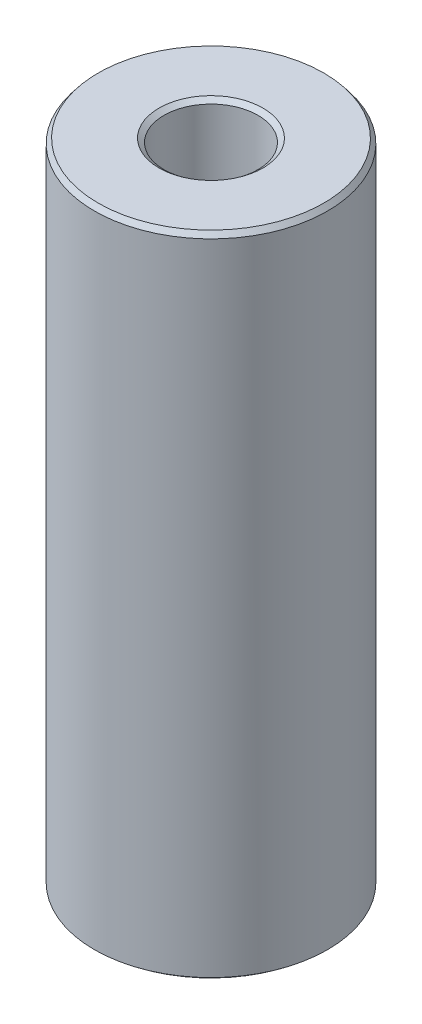
ISO-10303-21;
HEADER;
FILE_DESCRIPTION(('STEP AP214'),'2;1');
FILE_NAME('part.step','',(''),(''),'','','');
FILE_SCHEMA(('AUTOMOTIVE_DESIGN { 1 0 10303 214 1 1 1 1 }'));
ENDSEC;
DATA;
#1=APPLICATION_CONTEXT('core data for automotive mechanical design processes');
#2=APPLICATION_PROTOCOL_DEFINITION('international standard','automotive_design',2000,#1);
#3=PRODUCT_CONTEXT('',#1,'mechanical');
#4=PRODUCT('Part','Part','',(#3));
#5=PRODUCT_RELATED_PRODUCT_CATEGORY('part','',(#4));
#6=PRODUCT_DEFINITION_FORMATION('','',#4);
#7=PRODUCT_DEFINITION_CONTEXT('part definition',#1,'design');
#8=PRODUCT_DEFINITION('design','',#6,#7);
#9=PRODUCT_DEFINITION_SHAPE('','',#8);
#10=(LENGTH_UNIT() NAMED_UNIT(*) SI_UNIT(.MILLI.,.METRE.));
#11=(NAMED_UNIT(*) PLANE_ANGLE_UNIT() SI_UNIT($,.RADIAN.));
#12=(NAMED_UNIT(*) SI_UNIT($,.STERADIAN.) SOLID_ANGLE_UNIT());
#13=UNCERTAINTY_MEASURE_WITH_UNIT(LENGTH_MEASURE(1.E-05),#10,'distance_accuracy_value','');
#14=(GEOMETRIC_REPRESENTATION_CONTEXT(3) GLOBAL_UNCERTAINTY_ASSIGNED_CONTEXT((#13)) GLOBAL_UNIT_ASSIGNED_CONTEXT((#10,
#11,#12)) REPRESENTATION_CONTEXT('',''));
#15=CARTESIAN_POINT('',(0.,0.,0.));
#16=DIRECTION('',(0.,0.,1.));
#17=DIRECTION('',(1.,0.,0.));
#18=AXIS2_PLACEMENT_3D('',#15,#16,#17);
#19=CARTESIAN_POINT('',(0.,305.918689171628,0.));
#20=DIRECTION('',(0.,-1.,0.));
#21=DIRECTION('',(0.,0.,-1.));
#22=AXIS2_PLACEMENT_3D('',#19,#20,#21);
#23=CYLINDRICAL_SURFACE('',#22,55.);
#24=CARTESIAN_POINT('',(0.,1.80215994976524,0.));
#25=DIRECTION('',(0.,1.,0.));
#26=DIRECTION('',(0.,0.,1.));
#27=AXIS2_PLACEMENT_3D('',#24,#25,#26);
#28=CIRCLE('',#27,55.);
#29=CARTESIAN_POINT('',(0.,1.80215994976524,-55.));
#30=VERTEX_POINT('',#29);
#31=EDGE_CURVE('E10',#30,#30,#28,.T.);
#32=CARTESIAN_POINT('',(0.,303.600709281203,0.));
#33=DIRECTION('',(0.,1.,0.));
#34=DIRECTION('',(0.,0.,1.));
#35=AXIS2_PLACEMENT_3D('',#32,#33,#34);
#36=CIRCLE('',#35,55.);
#37=CARTESIAN_POINT('',(0.,303.600709281203,-55.));
#38=VERTEX_POINT('',#37);
#39=EDGE_CURVE('E50',#38,#38,#36,.F.);
#40=CARTESIAN_POINT('',(0.,1.80215994976524,-55.));
#41=CARTESIAN_POINT('',(0.,4.94589483863437,-55.));
#42=CARTESIAN_POINT('',(0.,8.08962972750351,-55.));
#43=CARTESIAN_POINT('',(0.,14.3770995052418,-55.));
#44=CARTESIAN_POINT('',(0.,17.5208343941109,-55.));
#45=CARTESIAN_POINT('',(0.,23.8083041718492,-55.));
#46=CARTESIAN_POINT('',(0.,26.9520390607183,-55.));
#47=CARTESIAN_POINT('',(0.,33.2395088384566,-55.));
#48=CARTESIAN_POINT('',(0.,36.3832437273257,-55.));
#49=CARTESIAN_POINT('',(0.,42.670713505064,-55.));
#50=CARTESIAN_POINT('',(0.,45.8144483939332,-55.));
#51=CARTESIAN_POINT('',(0.,52.1019181716715,-55.));
#52=CARTESIAN_POINT('',(0.,55.2456530605406,-55.));
#53=CARTESIAN_POINT('',(0.,61.5331228382789,-55.));
#54=CARTESIAN_POINT('',(0.,64.676857727148,-55.));
#55=CARTESIAN_POINT('',(0.,70.9643275048863,-55.));
#56=CARTESIAN_POINT('',(0.,74.1080623937554,-55.));
#57=CARTESIAN_POINT('',(0.,80.3955321714937,-55.));
#58=CARTESIAN_POINT('',(0.,83.5392670603628,-55.));
#59=CARTESIAN_POINT('',(0.,89.8267368381011,-55.));
#60=CARTESIAN_POINT('',(0.,92.9704717269702,-55.));
#61=CARTESIAN_POINT('',(0.,99.2579415047085,-55.));
#62=CARTESIAN_POINT('',(0.,102.401676393578,-55.));
#63=CARTESIAN_POINT('',(0.,108.689146171316,-55.));
#64=CARTESIAN_POINT('',(0.,111.832881060185,-55.));
#65=CARTESIAN_POINT('',(0.,118.120350837923,-55.));
#66=CARTESIAN_POINT('',(0.,121.264085726792,-55.));
#67=CARTESIAN_POINT('',(0.,127.551555504531,-55.));
#68=CARTESIAN_POINT('',(0.,130.6952903934,-55.));
#69=CARTESIAN_POINT('',(0.,136.982760171138,-55.));
#70=CARTESIAN_POINT('',(0.,140.126495060007,-55.));
#71=CARTESIAN_POINT('',(0.,146.413964837746,-55.));
#72=CARTESIAN_POINT('',(0.,149.557699726615,-55.));
#73=CARTESIAN_POINT('',(0.,155.845169504353,-55.));
#74=CARTESIAN_POINT('',(0.,158.988904393222,-55.));
#75=CARTESIAN_POINT('',(0.,165.27637417096,-55.));
#76=CARTESIAN_POINT('',(0.,168.42010905983,-55.));
#77=CARTESIAN_POINT('',(0.,174.707578837568,-55.));
#78=CARTESIAN_POINT('',(0.,177.851313726437,-55.));
#79=CARTESIAN_POINT('',(0.,184.138783504175,-55.));
#80=CARTESIAN_POINT('',(0.,187.282518393044,-55.));
#81=CARTESIAN_POINT('',(0.,193.569988170783,-55.));
#82=CARTESIAN_POINT('',(0.,196.713723059652,-55.));
#83=CARTESIAN_POINT('',(0.,203.00119283739,-55.));
#84=CARTESIAN_POINT('',(0.,206.144927726259,-55.));
#85=CARTESIAN_POINT('',(0.,212.432397503997,-55.));
#86=CARTESIAN_POINT('',(0.,215.576132392867,-55.));
#87=CARTESIAN_POINT('',(0.,221.863602170605,-55.));
#88=CARTESIAN_POINT('',(0.,225.007337059474,-55.));
#89=CARTESIAN_POINT('',(0.,231.294806837212,-55.));
#90=CARTESIAN_POINT('',(0.,234.438541726081,-55.));
#91=CARTESIAN_POINT('',(0.,240.72601150382,-55.));
#92=CARTESIAN_POINT('',(0.,243.869746392689,-55.));
#93=CARTESIAN_POINT('',(0.,250.157216170427,-55.));
#94=CARTESIAN_POINT('',(0.,253.300951059296,-55.));
#95=CARTESIAN_POINT('',(0.,259.588420837035,-55.));
#96=CARTESIAN_POINT('',(0.,262.732155725904,-55.));
#97=CARTESIAN_POINT('',(0.,269.019625503642,-55.));
#98=CARTESIAN_POINT('',(0.,272.163360392511,-55.));
#99=CARTESIAN_POINT('',(0.,278.450830170249,-55.));
#100=CARTESIAN_POINT('',(0.,281.594565059119,-55.));
#101=CARTESIAN_POINT('',(0.,287.882034836857,-55.));
#102=CARTESIAN_POINT('',(0.,291.025769725726,-55.));
#103=CARTESIAN_POINT('',(0.,297.313239503464,-55.));
#104=CARTESIAN_POINT('',(0.,300.456974392333,-55.));
#105=CARTESIAN_POINT('',(0.,303.600709281202,-55.));
#106=B_SPLINE_CURVE_WITH_KNOTS('',3,(#40,#41,#42,#43,#44,#45,#46,#47,#48,#49,#50,#51,#52,#53,
#54,#55,#56,#57,#58,#59,#60,#61,#62,#63,#64,#65,#66,#67,#68,#69,#70,#71,#72,#73,#74,#75,#76,#77,
#78,#79,#80,#81,#82,#83,#84,#85,#86,#87,#88,#89,#90,#91,#92,#93,#94,#95,#96,#97,#98,#99,#100,
#101,#102,#103,#104,#105),.UNSPECIFIED.,.F.,.F.,(4,2,2,2,2,2,2,2,2,2,2,2,2,2,2,2,2,2,2,2,2,2,2,
2,2,2,2,2,2,2,2,2,4),(0.,9.43120466660741,18.8624093332148,28.2936139998222,37.7248186664296,
47.1560233330371,56.5872279996445,66.0184326662519,75.4496373328593,84.8808419994667,
94.3120466660741,103.743251332682,113.174455999289,122.605660665896,132.036865332504,
141.468069999111,150.899274665719,160.330479332326,169.761683998933,179.192888665541,
188.624093332148,198.055297998756,207.486502665363,216.917707331971,226.348911998578,
235.780116665185,245.211321331793,254.6425259984,264.073730665008,273.504935331615,
282.936139998222,292.36734466483,301.798549331437),.UNSPECIFIED.);
#107=EDGE_CURVE('BSEAM39',#30,#38,#106,.T.);
#108=ORIENTED_EDGE('',*,*,#31,.T.);
#109=ORIENTED_EDGE('',*,*,#39,.T.);
#110=ORIENTED_EDGE('',*,*,#107,.T.);
#111=ORIENTED_EDGE('',*,*,#107,.F.);
#112=EDGE_LOOP('',(#108,#110,#109,#111));
#113=FACE_BOUND('',#112,.T.);
#114=ADVANCED_FACE('F39',(#113),#23,.T.);
#115=CARTESIAN_POINT('',(0.,305.918689171628,0.));
#116=DIRECTION('',(0.,1.,0.));
#117=DIRECTION('',(0.,0.,1.));
#118=AXIS2_PLACEMENT_3D('',#115,#116,#117);
#119=PLANE('',#118);
#120=CARTESIAN_POINT('',(0.,305.918689171628,0.));
#121=DIRECTION('',(0.,1.,0.));
#122=DIRECTION('',(0.,0.,1.));
#123=AXIS2_PLACEMENT_3D('',#120,#121,#122);
#124=CIRCLE('',#123,24.5124621524329);
#125=CARTESIAN_POINT('',(0.,305.918689171628,24.5124621524329));
#126=VERTEX_POINT('',#125);
#127=EDGE_CURVE('E58',#126,#126,#124,.F.);
#128=ORIENTED_EDGE('',*,*,#127,.T.);
#129=EDGE_LOOP('',(#128));
#130=FACE_BOUND('',#129,.T.);
#131=CARTESIAN_POINT('',(0.,305.918689171628,0.));
#132=DIRECTION('',(0.,1.,0.));
#133=DIRECTION('',(0.,0.,1.));
#134=AXIS2_PLACEMENT_3D('',#131,#132,#133);
#135=CIRCLE('',#134,53.1978400502348);
#136=CARTESIAN_POINT('',(0.,305.918689171628,-53.1978400502348));
#137=VERTEX_POINT('',#136);
#138=EDGE_CURVE('E61',#137,#137,#135,.T.);
#139=ORIENTED_EDGE('',*,*,#138,.T.);
#140=EDGE_LOOP('',(#139));
#141=FACE_BOUND('',#140,.T.);
#142=ADVANCED_FACE('F88',(#130,#141),#119,.T.);
#143=CARTESIAN_POINT('',(0.,0.,0.));
#144=DIRECTION('',(0.,1.,0.));
#145=DIRECTION('',(0.,0.,1.));
#146=AXIS2_PLACEMENT_3D('',#143,#144,#145);
#147=PLANE('',#146);
#148=CARTESIAN_POINT('',(0.,0.,0.));
#149=DIRECTION('',(0.,1.,0.));
#150=DIRECTION('',(0.,0.,1.));
#151=AXIS2_PLACEMENT_3D('',#148,#149,#150);
#152=CIRCLE('',#151,23.9966422117722);
#153=CARTESIAN_POINT('',(0.,0.,23.9966422117722));
#154=VERTEX_POINT('',#153);
#155=EDGE_CURVE('E51',#154,#154,#152,.T.);
#156=ORIENTED_EDGE('',*,*,#155,.T.);
#157=EDGE_LOOP('',(#156));
#158=FACE_BOUND('',#157,.T.);
#159=CARTESIAN_POINT('',(0.,0.,0.));
#160=DIRECTION('',(0.,1.,0.));
#161=DIRECTION('',(0.,0.,1.));
#162=AXIS2_PLACEMENT_3D('',#159,#160,#161);
#163=CIRCLE('',#162,52.6820201095741);
#164=CARTESIAN_POINT('',(0.,0.,52.6820201095741));
#165=VERTEX_POINT('',#164);
#166=EDGE_CURVE('E54',#165,#165,#163,.F.);
#167=ORIENTED_EDGE('',*,*,#166,.T.);
#168=EDGE_LOOP('',(#167));
#169=FACE_BOUND('',#168,.T.);
#170=ADVANCED_FACE('F83',(#158,#169),#147,.F.);
#171=CARTESIAN_POINT('',(0.,305.918689171628,0.));
#172=DIRECTION('',(0.,-1.,0.));
#173=DIRECTION('',(0.,0.,-1.));
#174=AXIS2_PLACEMENT_3D('',#171,#172,#173);
#175=CYLINDRICAL_SURFACE('',#174,22.1944822620069);
#176=CARTESIAN_POINT('',(0.,304.116529221863,0.));
#177=DIRECTION('',(0.,1.,0.));
#178=DIRECTION('',(0.,0.,1.));
#179=AXIS2_PLACEMENT_3D('',#176,#177,#178);
#180=CIRCLE('',#179,22.1944822620069);
#181=CARTESIAN_POINT('',(0.,304.116529221863,22.1944822620069));
#182=VERTEX_POINT('',#181);
#183=EDGE_CURVE('E67',#182,#182,#180,.T.);
#184=ORIENTED_EDGE('',*,*,#183,.T.);
#185=EDGE_LOOP('',(#184));
#186=FACE_BOUND('',#185,.T.);
#187=CARTESIAN_POINT('',(0.,2.31797989042598,0.));
#188=DIRECTION('',(0.,1.,0.));
#189=DIRECTION('',(0.,0.,1.));
#190=AXIS2_PLACEMENT_3D('',#187,#188,#189);
#191=CIRCLE('',#190,22.1944822620069);
#192=CARTESIAN_POINT('',(0.,2.31797989042598,22.1944822620069));
#193=VERTEX_POINT('',#192);
#194=EDGE_CURVE('E69',#193,#193,#191,.F.);
#195=ORIENTED_EDGE('',*,*,#194,.T.);
#196=EDGE_LOOP('',(#195));
#197=FACE_BOUND('',#196,.T.);
#198=ADVANCED_FACE('F71',(#186,#197),#175,.F.);
#199=CARTESIAN_POINT('',(0.,304.116529221863,0.));
#200=DIRECTION('',(0.,1.,0.));
#201=DIRECTION('',(0.,0.,1.));
#202=AXIS2_PLACEMENT_3D('',#199,#200,#201);
#203=CONICAL_SURFACE('',#202,22.1944822620069,0.909944922343002);
#204=CARTESIAN_POINT('',(0.,305.918689171628,24.5124621524329));
#205=CARTESIAN_POINT('',(0.,305.899916672152,24.4883165285743));
#206=CARTESIAN_POINT('',(0.,305.881144172675,24.4641709047157));
#207=CARTESIAN_POINT('',(0.,305.843599173721,24.4158796569985));
#208=CARTESIAN_POINT('',(0.,305.824826674245,24.3917340331399));
#209=CARTESIAN_POINT('',(0.,305.787281675291,24.3434427854226));
#210=CARTESIAN_POINT('',(0.,305.768509175815,24.319297161564));
#211=CARTESIAN_POINT('',(0.,305.730964176861,24.2710059138468));
#212=CARTESIAN_POINT('',(0.,305.712191677384,24.2468602899882));
#213=CARTESIAN_POINT('',(0.,305.674646678431,24.198569042271));
#214=CARTESIAN_POINT('',(0.,305.655874178954,24.1744234184124));
#215=CARTESIAN_POINT('',(0.,305.618329180001,24.1261321706952));
#216=CARTESIAN_POINT('',(0.,305.599556680524,24.1019865468366));
#217=CARTESIAN_POINT('',(0.,305.562011681571,24.0536952991194));
#218=CARTESIAN_POINT('',(0.,305.543239182094,24.0295496752608));
#219=CARTESIAN_POINT('',(0.,305.505694183141,23.9812584275436));
#220=CARTESIAN_POINT('',(0.,305.486921683664,23.957112803685));
#221=CARTESIAN_POINT('',(0.,305.44937668471,23.9088215559678));
#222=CARTESIAN_POINT('',(0.,305.430604185234,23.8846759321092));
#223=CARTESIAN_POINT('',(0.,305.39305918628,23.836384684392));
#224=CARTESIAN_POINT('',(0.,305.374286686803,23.8122390605334));
#225=CARTESIAN_POINT('',(0.,305.33674168785,23.7639478128162));
#226=CARTESIAN_POINT('',(0.,305.317969188373,23.7398021889576));
#227=CARTESIAN_POINT('',(0.,305.28042418942,23.6915109412404));
#228=CARTESIAN_POINT('',(0.,305.261651689943,23.6673653173817));
#229=CARTESIAN_POINT('',(0.,305.22410669099,23.6190740696645));
#230=CARTESIAN_POINT('',(0.,305.205334191513,23.5949284458059));
#231=CARTESIAN_POINT('',(0.,305.167789192559,23.5466371980887));
#232=CARTESIAN_POINT('',(0.,305.149016693083,23.5224915742301));
#233=CARTESIAN_POINT('',(0.,305.111471694129,23.4742003265129));
#234=CARTESIAN_POINT('',(0.,305.092699194653,23.4500547026543));
#235=CARTESIAN_POINT('',(0.,305.055154195699,23.4017634549371));
#236=CARTESIAN_POINT('',(0.,305.036381696223,23.3776178310785));
#237=CARTESIAN_POINT('',(0.,304.998836697269,23.3293265833613));
#238=CARTESIAN_POINT('',(0.,304.980064197792,23.3051809595027));
#239=CARTESIAN_POINT('',(0.,304.942519198839,23.2568897117855));
#240=CARTESIAN_POINT('',(0.,304.923746699362,23.2327440879269));
#241=CARTESIAN_POINT('',(0.,304.886201700409,23.1844528402097));
#242=CARTESIAN_POINT('',(0.,304.867429200932,23.1603072163511));
#243=CARTESIAN_POINT('',(0.,304.829884201979,23.1120159686339));
#244=CARTESIAN_POINT('',(0.,304.811111702502,23.0878703447753));
#245=CARTESIAN_POINT('',(0.,304.773566703548,23.039579097058));
#246=CARTESIAN_POINT('',(0.,304.754794204072,23.0154334731994));
#247=CARTESIAN_POINT('',(0.,304.717249205118,22.9671422254822));
#248=CARTESIAN_POINT('',(0.,304.698476705641,22.9429966016236));
#249=CARTESIAN_POINT('',(0.,304.660931706688,22.8947053539064));
#250=CARTESIAN_POINT('',(0.,304.642159207211,22.8705597300478));
#251=CARTESIAN_POINT('',(0.,304.604614208258,22.8222684823306));
#252=CARTESIAN_POINT('',(0.,304.585841708781,22.798122858472));
#253=CARTESIAN_POINT('',(0.,304.548296709828,22.7498316107548));
#254=CARTESIAN_POINT('',(0.,304.529524210351,22.7256859868962));
#255=CARTESIAN_POINT('',(0.,304.491979211398,22.677394739179));
#256=CARTESIAN_POINT('',(0.,304.473206711921,22.6532491153204));
#257=CARTESIAN_POINT('',(0.,304.435661712967,22.6049578676032));
#258=CARTESIAN_POINT('',(0.,304.416889213491,22.5808122437446));
#259=CARTESIAN_POINT('',(0.,304.379344214537,22.5325209960274));
#260=CARTESIAN_POINT('',(0.,304.360571715061,22.5083753721688));
#261=CARTESIAN_POINT('',(0.,304.323026716107,22.4600841244515));
#262=CARTESIAN_POINT('',(0.,304.30425421663,22.4359385005929));
#263=CARTESIAN_POINT('',(0.,304.266709217677,22.3876472528757));
#264=CARTESIAN_POINT('',(0.,304.2479367182,22.3635016290171));
#265=CARTESIAN_POINT('',(0.,304.210391719247,22.3152103812999));
#266=CARTESIAN_POINT('',(0.,304.19161921977,22.2910647574413));
#267=CARTESIAN_POINT('',(0.,304.154074220817,22.2427735097241));
#268=CARTESIAN_POINT('',(0.,304.13530172134,22.2186278858655));
#269=CARTESIAN_POINT('',(0.,304.116529221863,22.1944822620069));
#270=B_SPLINE_CURVE_WITH_KNOTS('',3,(#204,#205,#206,#207,#208,#209,#210,#211,#212,#213,#214,
#215,#216,#217,#218,#219,#220,#221,#222,#223,#224,#225,#226,#227,#228,#229,#230,#231,#232,#233,
#234,#235,#236,#237,#238,#239,#240,#241,#242,#243,#244,#245,#246,#247,#248,#249,#250,#251,#252,
#253,#254,#255,#256,#257,#258,#259,#260,#261,#262,#263,#264,#265,#266,#267,#268,#269),
.UNSPECIFIED.,.F.,.F.,(4,2,2,2,2,2,2,2,2,2,2,2,2,2,2,2,2,2,2,2,2,2,2,2,2,2,2,2,2,2,2,2,4),(0.,
0.091753806423102,0.183507612846167,0.275261419269232,0.3670152256923,0.458769032115365,
0.550522838538433,0.642276644961498,0.734030451384563,0.825784257807631,0.917538064230697,
1.0092918706538,1.10104567707686,1.19279948349993,1.284553289923,1.37630709634606,
1.46806090276913,1.5598147091922,1.65156851561526,1.74332232203833,1.83507612846139,
1.92682993488446,2.01858374130756,2.11033754773063,2.20209135415369,2.29384516057676,
2.38559896699983,2.47735277342289,2.56910657984596,2.66086038626902,2.75261419269209,
2.84436799911516,2.93612180553822),.UNSPECIFIED.);
#271=EDGE_CURVE('BSEAM77',#126,#182,#270,.T.);
#272=ORIENTED_EDGE('',*,*,#127,.F.);
#273=ORIENTED_EDGE('',*,*,#183,.F.);
#274=ORIENTED_EDGE('',*,*,#271,.T.);
#275=ORIENTED_EDGE('',*,*,#271,.F.);
#276=EDGE_LOOP('',(#272,#274,#273,#275));
#277=FACE_BOUND('',#276,.T.);
#278=ADVANCED_FACE('F77',(#277),#203,.F.);
#279=CARTESIAN_POINT('',(0.,0.,0.));
#280=DIRECTION('',(0.,-1.,0.));
#281=DIRECTION('',(0.,0.,-1.));
#282=AXIS2_PLACEMENT_3D('',#279,#280,#281);
#283=CONICAL_SURFACE('',#282,23.9966422117722,0.660851404451903);
#284=ORIENTED_EDGE('',*,*,#194,.F.);
#285=EDGE_LOOP('',(#284));
#286=FACE_BOUND('',#285,.T.);
#287=ORIENTED_EDGE('',*,*,#155,.F.);
#288=EDGE_LOOP('',(#287));
#289=FACE_BOUND('',#288,.T.);
#290=ADVANCED_FACE('F73',(#286,#289),#283,.F.);
#291=CARTESIAN_POINT('',(0.,1.80215994976524,0.));
#292=DIRECTION('',(0.,1.,0.));
#293=DIRECTION('',(0.,0.,1.));
#294=AXIS2_PLACEMENT_3D('',#291,#292,#293);
#295=CONICAL_SURFACE('',#294,55.,0.909944922342994);
#296=ORIENTED_EDGE('',*,*,#166,.F.);
#297=EDGE_LOOP('',(#296));
#298=FACE_BOUND('',#297,.T.);
#299=ORIENTED_EDGE('',*,*,#31,.F.);
#300=EDGE_LOOP('',(#299));
#301=FACE_BOUND('',#300,.T.);
#302=ADVANCED_FACE('F76',(#298,#301),#295,.T.);
#303=CARTESIAN_POINT('',(0.,305.918689171628,0.));
#304=DIRECTION('',(0.,-1.,0.));
#305=DIRECTION('',(0.,0.,-1.));
#306=AXIS2_PLACEMENT_3D('',#303,#304,#305);
#307=CONICAL_SURFACE('',#306,53.1978400502348,0.660851404451902);
#308=CARTESIAN_POINT('',(0.,303.600709281202,-55.));
#309=CARTESIAN_POINT('',(0.,303.624854905061,-54.9812275005233));
#310=CARTESIAN_POINT('',(0.,303.64900052892,-54.9624550010466));
#311=CARTESIAN_POINT('',(0.,303.697291776637,-54.9249100020931));
#312=CARTESIAN_POINT('',(0.,303.721437400496,-54.9061375026164));
#313=CARTESIAN_POINT('',(0.,303.769728648213,-54.868592503663));
#314=CARTESIAN_POINT('',(0.,303.793874272071,-54.8498200041863));
#315=CARTESIAN_POINT('',(0.,303.842165519789,-54.8122750052328));
#316=CARTESIAN_POINT('',(0.,303.866311143647,-54.7935025057561));
#317=CARTESIAN_POINT('',(0.,303.914602391364,-54.7559575068027));
#318=CARTESIAN_POINT('',(0.,303.938748015223,-54.7371850073259));
#319=CARTESIAN_POINT('',(0.,303.98703926294,-54.6996400083725));
#320=CARTESIAN_POINT('',(0.,304.011184886799,-54.6808675088958));
#321=CARTESIAN_POINT('',(0.,304.059476134516,-54.6433225099423));
#322=CARTESIAN_POINT('',(0.,304.083621758375,-54.6245500104656));
#323=CARTESIAN_POINT('',(0.,304.131913006092,-54.5870050115122));
#324=CARTESIAN_POINT('',(0.,304.15605862995,-54.5682325120354));
#325=CARTESIAN_POINT('',(0.,304.204349877668,-54.530687513082));
#326=CARTESIAN_POINT('',(0.,304.228495501526,-54.5119150136053));
#327=CARTESIAN_POINT('',(0.,304.276786749243,-54.4743700146518));
#328=CARTESIAN_POINT('',(0.,304.300932373102,-54.4555975151751));
#329=CARTESIAN_POINT('',(0.,304.349223620819,-54.4180525162217));
#330=CARTESIAN_POINT('',(0.,304.373369244678,-54.399280016745));
#331=CARTESIAN_POINT('',(0.,304.421660492395,-54.3617350177915));
#332=CARTESIAN_POINT('',(0.,304.445806116254,-54.3429625183148));
#333=CARTESIAN_POINT('',(0.,304.494097363971,-54.3054175193614));
#334=CARTESIAN_POINT('',(0.,304.518242987829,-54.2866450198846));
#335=CARTESIAN_POINT('',(0.,304.566534235547,-54.2491000209312));
#336=CARTESIAN_POINT('',(0.,304.590679859405,-54.2303275214545));
#337=CARTESIAN_POINT('',(0.,304.638971107122,-54.192782522501));
#338=CARTESIAN_POINT('',(0.,304.663116730981,-54.1740100230243));
#339=CARTESIAN_POINT('',(0.,304.711407978698,-54.1364650240709));
#340=CARTESIAN_POINT('',(0.,304.735553602557,-54.1176925245942));
#341=CARTESIAN_POINT('',(0.,304.783844850274,-54.0801475256407));
#342=CARTESIAN_POINT('',(0.,304.807990474133,-54.061375026164));
#343=CARTESIAN_POINT('',(0.,304.85628172185,-54.0238300272106));
#344=CARTESIAN_POINT('',(0.,304.880427345708,-54.0050575277338));
#345=CARTESIAN_POINT('',(0.,304.928718593426,-53.9675125287804));
#346=CARTESIAN_POINT('',(0.,304.952864217284,-53.9487400293037));
#347=CARTESIAN_POINT('',(0.,305.001155465001,-53.9111950303502));
#348=CARTESIAN_POINT('',(0.,305.02530108886,-53.8924225308735));
#349=CARTESIAN_POINT('',(0.,305.073592336577,-53.8548775319201));
#350=CARTESIAN_POINT('',(0.,305.097737960436,-53.8361050324433));
#351=CARTESIAN_POINT('',(0.,305.146029208153,-53.7985600334899));
#352=CARTESIAN_POINT('',(0.,305.170174832012,-53.7797875340132));
#353=CARTESIAN_POINT('',(0.,305.218466079729,-53.7422425350597));
#354=CARTESIAN_POINT('',(0.,305.242611703587,-53.723470035583));
#355=CARTESIAN_POINT('',(0.,305.290902951305,-53.6859250366296));
#356=CARTESIAN_POINT('',(0.,305.315048575163,-53.6671525371528));
#357=CARTESIAN_POINT('',(0.,305.363339822881,-53.6296075381994));
#358=CARTESIAN_POINT('',(0.,305.387485446739,-53.6108350387227));
#359=CARTESIAN_POINT('',(0.,305.435776694456,-53.5732900397692));
#360=CARTESIAN_POINT('',(0.,305.459922318315,-53.5545175402925));
#361=CARTESIAN_POINT('',(0.,305.508213566032,-53.5169725413391));
#362=CARTESIAN_POINT('',(0.,305.532359189891,-53.4982000418624));
#363=CARTESIAN_POINT('',(0.,305.580650437608,-53.4606550429089));
#364=CARTESIAN_POINT('',(0.,305.604796061467,-53.4418825434322));
#365=CARTESIAN_POINT('',(0.,305.653087309184,-53.4043375444788));
#366=CARTESIAN_POINT('',(0.,305.677232933042,-53.385565045002));
#367=CARTESIAN_POINT('',(0.,305.72552418076,-53.3480200460486));
#368=CARTESIAN_POINT('',(0.,305.749669804618,-53.3292475465719));
#369=CARTESIAN_POINT('',(0.,305.797961052335,-53.2917025476184));
#370=CARTESIAN_POINT('',(0.,305.822106676194,-53.2729300481417));
#371=CARTESIAN_POINT('',(0.,305.870397923911,-53.2353850491883));
#372=CARTESIAN_POINT('',(0.,305.89454354777,-53.2166125497116));
#373=CARTESIAN_POINT('',(0.,305.918689171628,-53.1978400502348));
#374=B_SPLINE_CURVE_WITH_KNOTS('',3,(#308,#309,#310,#311,#312,#313,#314,#315,#316,#317,#318,
#319,#320,#321,#322,#323,#324,#325,#326,#327,#328,#329,#330,#331,#332,#333,#334,#335,#336,#337,
#338,#339,#340,#341,#342,#343,#344,#345,#346,#347,#348,#349,#350,#351,#352,#353,#354,#355,#356,
#357,#358,#359,#360,#361,#362,#363,#364,#365,#366,#367,#368,#369,#370,#371,#372,#373),
.UNSPECIFIED.,.F.,.F.,(4,2,2,2,2,2,2,2,2,2,2,2,2,2,2,2,2,2,2,2,2,2,2,2,2,2,2,2,2,2,2,2,4),(0.,
0.0917538064230734,0.183507612846151,0.275261419269224,0.367015225692302,0.458769032115332,
0.550522838538409,0.642276644961487,0.73403045138456,0.825784257807638,0.917538064230667,
1.00929187065374,1.10104567707682,1.1927994834999,1.28455328992293,1.376307096346,
1.46806090276908,1.55981470919215,1.65156851561523,1.74332232203826,1.83507612846133,
1.92682993488441,2.01858374130749,2.11033754773052,2.2020913541536,2.29384516057667,
2.38559896699975,2.47735277342282,2.56910657984585,2.66086038626893,2.75261419269201,
2.84436799911508,2.93612180553816),.UNSPECIFIED.);
#375=EDGE_CURVE('BSEAM45',#38,#137,#374,.T.);
#376=ORIENTED_EDGE('',*,*,#39,.F.);
#377=ORIENTED_EDGE('',*,*,#138,.F.);
#378=ORIENTED_EDGE('',*,*,#375,.T.);
#379=ORIENTED_EDGE('',*,*,#375,.F.);
#380=EDGE_LOOP('',(#376,#378,#377,#379));
#381=FACE_BOUND('',#380,.T.);
#382=ADVANCED_FACE('F45',(#381),#307,.T.);
#383=CLOSED_SHELL('',(#114,#142,#170,#198,#278,#290,#302,#382));
#384=MANIFOLD_SOLID_BREP('B2',#383);
#385=ADVANCED_BREP_SHAPE_REPRESENTATION('',(#18,#384),#14);
#386=SHAPE_DEFINITION_REPRESENTATION(#9,#385);
ENDSEC;
END-ISO-10303-21;
